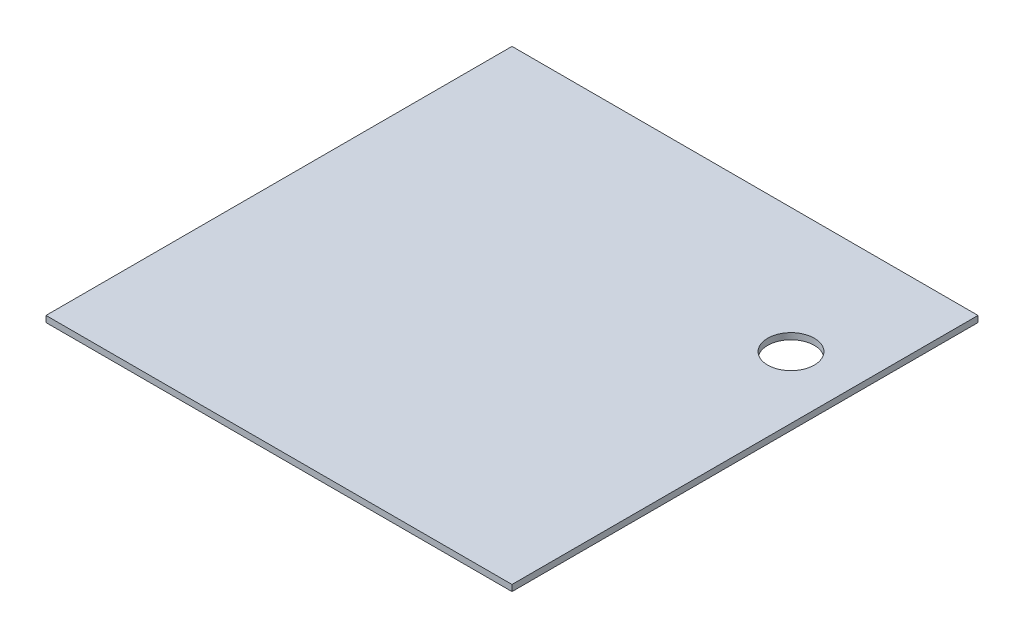
ISO-10303-21;
HEADER;
FILE_DESCRIPTION(('STEP AP214'),'2;1');
FILE_NAME('part.step','',(''),(''),'','','');
FILE_SCHEMA(('AUTOMOTIVE_DESIGN { 1 0 10303 214 1 1 1 1 }'));
ENDSEC;
DATA;
#1=APPLICATION_CONTEXT('core data for automotive mechanical design processes');
#2=APPLICATION_PROTOCOL_DEFINITION('international standard','automotive_design',2000,#1);
#3=PRODUCT_CONTEXT('',#1,'mechanical');
#4=PRODUCT('Part','Part','',(#3));
#5=PRODUCT_RELATED_PRODUCT_CATEGORY('part','',(#4));
#6=PRODUCT_DEFINITION_FORMATION('','',#4);
#7=PRODUCT_DEFINITION_CONTEXT('part definition',#1,'design');
#8=PRODUCT_DEFINITION('design','',#6,#7);
#9=PRODUCT_DEFINITION_SHAPE('','',#8);
#10=(LENGTH_UNIT() NAMED_UNIT(*) SI_UNIT(.MILLI.,.METRE.));
#11=(NAMED_UNIT(*) PLANE_ANGLE_UNIT() SI_UNIT($,.RADIAN.));
#12=(NAMED_UNIT(*) SI_UNIT($,.STERADIAN.) SOLID_ANGLE_UNIT());
#13=UNCERTAINTY_MEASURE_WITH_UNIT(LENGTH_MEASURE(1.E-05),#10,'distance_accuracy_value','');
#14=(GEOMETRIC_REPRESENTATION_CONTEXT(3) GLOBAL_UNCERTAINTY_ASSIGNED_CONTEXT((#13)) GLOBAL_UNIT_ASSIGNED_CONTEXT((#10,
#11,#12)) REPRESENTATION_CONTEXT('',''));
#15=CARTESIAN_POINT('',(0.,0.,0.));
#16=DIRECTION('',(0.,0.,1.));
#17=DIRECTION('',(1.,0.,0.));
#18=AXIS2_PLACEMENT_3D('',#15,#16,#17);
#19=CARTESIAN_POINT('',(75.,2.,-75.));
#20=DIRECTION('',(-1.,0.,0.));
#21=DIRECTION('',(0.,0.,1.));
#22=AXIS2_PLACEMENT_3D('',#19,#20,#21);
#23=PLANE('',#22);
#24=DIRECTION('',(0.,0.,-1.));
#25=VECTOR('',#24,1.);
#26=CARTESIAN_POINT('',(75.,0.,-75.));
#27=LINE('',#26,#25);
#28=CARTESIAN_POINT('',(75.,0.,75.));
#29=VERTEX_POINT('',#28);
#30=CARTESIAN_POINT('',(75.,0.,-75.));
#31=VERTEX_POINT('',#30);
#32=EDGE_CURVE('E97',#29,#31,#27,.T.);
#33=ORIENTED_EDGE('',*,*,#32,.T.);
#34=DIRECTION('',(0.,-1.,0.));
#35=VECTOR('',#34,1.);
#36=CARTESIAN_POINT('',(75.,2.,-75.));
#37=LINE('',#36,#35);
#38=CARTESIAN_POINT('',(75.,2.,-75.));
#39=VERTEX_POINT('',#38);
#40=EDGE_CURVE('E11',#39,#31,#37,.T.);
#41=ORIENTED_EDGE('',*,*,#40,.F.);
#42=DIRECTION('',(0.,0.,-1.));
#43=VECTOR('',#42,1.);
#44=CARTESIAN_POINT('',(75.,2.,-75.));
#45=LINE('',#44,#43);
#46=CARTESIAN_POINT('',(75.,2.,75.));
#47=VERTEX_POINT('',#46);
#48=EDGE_CURVE('E85',#47,#39,#45,.T.);
#49=ORIENTED_EDGE('',*,*,#48,.F.);
#50=DIRECTION('',(0.,-1.,0.));
#51=VECTOR('',#50,1.);
#52=CARTESIAN_POINT('',(75.,2.,75.));
#53=LINE('',#52,#51);
#54=EDGE_CURVE('E93',#47,#29,#53,.T.);
#55=ORIENTED_EDGE('',*,*,#54,.T.);
#56=EDGE_LOOP('',(#33,#41,#49,#55));
#57=FACE_BOUND('',#56,.T.);
#58=ADVANCED_FACE('F34',(#57),#23,.F.);
#59=CARTESIAN_POINT('',(-75.,2.,-75.));
#60=DIRECTION('',(0.,0.,1.));
#61=DIRECTION('',(1.,0.,0.));
#62=AXIS2_PLACEMENT_3D('',#59,#60,#61);
#63=PLANE('',#62);
#64=DIRECTION('',(-1.,0.,0.));
#65=VECTOR('',#64,1.);
#66=CARTESIAN_POINT('',(-75.,0.,-75.));
#67=LINE('',#66,#65);
#68=CARTESIAN_POINT('',(-75.,0.,-75.));
#69=VERTEX_POINT('',#68);
#70=EDGE_CURVE('E89',#31,#69,#67,.T.);
#71=ORIENTED_EDGE('',*,*,#70,.T.);
#72=DIRECTION('',(0.,-1.,0.));
#73=VECTOR('',#72,1.);
#74=CARTESIAN_POINT('',(-75.,2.,-75.));
#75=LINE('',#74,#73);
#76=CARTESIAN_POINT('',(-75.,2.,-75.));
#77=VERTEX_POINT('',#76);
#78=EDGE_CURVE('E42',#77,#69,#75,.T.);
#79=ORIENTED_EDGE('',*,*,#78,.F.);
#80=DIRECTION('',(-1.,0.,0.));
#81=VECTOR('',#80,1.);
#82=CARTESIAN_POINT('',(-75.,2.,-75.));
#83=LINE('',#82,#81);
#84=EDGE_CURVE('E80',#39,#77,#83,.T.);
#85=ORIENTED_EDGE('',*,*,#84,.F.);
#86=ORIENTED_EDGE('',*,*,#40,.T.);
#87=EDGE_LOOP('',(#71,#79,#85,#86));
#88=FACE_BOUND('',#87,.T.);
#89=ADVANCED_FACE('F88',(#88),#63,.F.);
#90=CARTESIAN_POINT('',(-75.,2.,-75.));
#91=DIRECTION('',(1.,0.,0.));
#92=DIRECTION('',(0.,0.,-1.));
#93=AXIS2_PLACEMENT_3D('',#90,#91,#92);
#94=PLANE('',#93);
#95=DIRECTION('',(0.,0.,1.));
#96=VECTOR('',#95,1.);
#97=CARTESIAN_POINT('',(-75.,0.,-75.));
#98=LINE('',#97,#96);
#99=CARTESIAN_POINT('',(-75.,0.,75.));
#100=VERTEX_POINT('',#99);
#101=EDGE_CURVE('E67',#69,#100,#98,.T.);
#102=ORIENTED_EDGE('',*,*,#101,.T.);
#103=DIRECTION('',(0.,-1.,0.));
#104=VECTOR('',#103,1.);
#105=CARTESIAN_POINT('',(-75.,2.,75.));
#106=LINE('',#105,#104);
#107=CARTESIAN_POINT('',(-75.,2.,75.));
#108=VERTEX_POINT('',#107);
#109=EDGE_CURVE('E90',#108,#100,#106,.T.);
#110=ORIENTED_EDGE('',*,*,#109,.F.);
#111=DIRECTION('',(0.,0.,1.));
#112=VECTOR('',#111,1.);
#113=CARTESIAN_POINT('',(-75.,2.,-75.));
#114=LINE('',#113,#112);
#115=EDGE_CURVE('E83',#77,#108,#114,.T.);
#116=ORIENTED_EDGE('',*,*,#115,.F.);
#117=ORIENTED_EDGE('',*,*,#78,.T.);
#118=EDGE_LOOP('',(#102,#110,#116,#117));
#119=FACE_BOUND('',#118,.T.);
#120=ADVANCED_FACE('F91',(#119),#94,.F.);
#121=CARTESIAN_POINT('',(-75.,2.,75.));
#122=DIRECTION('',(0.,0.,-1.));
#123=DIRECTION('',(-1.,0.,0.));
#124=AXIS2_PLACEMENT_3D('',#121,#122,#123);
#125=PLANE('',#124);
#126=DIRECTION('',(1.,0.,0.));
#127=VECTOR('',#126,1.);
#128=CARTESIAN_POINT('',(-75.,0.,75.));
#129=LINE('',#128,#127);
#130=EDGE_CURVE('E73',#100,#29,#129,.T.);
#131=ORIENTED_EDGE('',*,*,#130,.T.);
#132=ORIENTED_EDGE('',*,*,#54,.F.);
#133=DIRECTION('',(1.,0.,0.));
#134=VECTOR('',#133,1.);
#135=CARTESIAN_POINT('',(-75.,2.,75.));
#136=LINE('',#135,#134);
#137=EDGE_CURVE('E50',#108,#47,#136,.T.);
#138=ORIENTED_EDGE('',*,*,#137,.F.);
#139=ORIENTED_EDGE('',*,*,#109,.T.);
#140=EDGE_LOOP('',(#131,#132,#138,#139));
#141=FACE_BOUND('',#140,.T.);
#142=ADVANCED_FACE('F105',(#141),#125,.F.);
#143=CARTESIAN_POINT('',(0.,2.,0.));
#144=DIRECTION('',(0.,1.,0.));
#145=DIRECTION('',(0.,0.,1.));
#146=AXIS2_PLACEMENT_3D('',#143,#144,#145);
#147=PLANE('',#146);
#148=CARTESIAN_POINT('',(55.0000000000001,2.,-34.807));
#149=DIRECTION('',(0.,1.,0.));
#150=DIRECTION('',(0.,0.,1.));
#151=AXIS2_PLACEMENT_3D('',#148,#149,#150);
#152=CIRCLE('',#151,7.5);
#153=CARTESIAN_POINT('',(55.0000000000001,2.,-27.307));
#154=VERTEX_POINT('',#153);
#155=EDGE_CURVE('E113',#154,#154,#152,.T.);
#156=ORIENTED_EDGE('',*,*,#155,.F.);
#157=EDGE_LOOP('',(#156));
#158=FACE_BOUND('',#157,.T.);
#159=ORIENTED_EDGE('',*,*,#48,.T.);
#160=ORIENTED_EDGE('',*,*,#84,.T.);
#161=ORIENTED_EDGE('',*,*,#115,.T.);
#162=ORIENTED_EDGE('',*,*,#137,.T.);
#163=EDGE_LOOP('',(#159,#160,#161,#162));
#164=FACE_BOUND('',#163,.T.);
#165=ADVANCED_FACE('F81',(#158,#164),#147,.T.);
#166=CARTESIAN_POINT('',(0.,0.,0.));
#167=DIRECTION('',(0.,1.,0.));
#168=DIRECTION('',(0.,0.,1.));
#169=AXIS2_PLACEMENT_3D('',#166,#167,#168);
#170=PLANE('',#169);
#171=CARTESIAN_POINT('',(55.0000000000001,0.,-34.807));
#172=DIRECTION('',(0.,1.,0.));
#173=DIRECTION('',(0.,0.,1.));
#174=AXIS2_PLACEMENT_3D('',#171,#172,#173);
#175=CIRCLE('',#174,7.5);
#176=CARTESIAN_POINT('',(55.0000000000001,0.,-27.307));
#177=VERTEX_POINT('',#176);
#178=EDGE_CURVE('E100',#177,#177,#175,.F.);
#179=ORIENTED_EDGE('',*,*,#178,.F.);
#180=EDGE_LOOP('',(#179));
#181=FACE_BOUND('',#180,.T.);
#182=ORIENTED_EDGE('',*,*,#32,.F.);
#183=ORIENTED_EDGE('',*,*,#130,.F.);
#184=ORIENTED_EDGE('',*,*,#101,.F.);
#185=ORIENTED_EDGE('',*,*,#70,.F.);
#186=EDGE_LOOP('',(#182,#183,#184,#185));
#187=FACE_BOUND('',#186,.T.);
#188=ADVANCED_FACE('F108',(#181,#187),#170,.F.);
#189=CARTESIAN_POINT('',(55.0000000000001,-0.00100000000000013,-34.807));
#190=DIRECTION('',(0.,1.,0.));
#191=DIRECTION('',(0.,0.,1.));
#192=AXIS2_PLACEMENT_3D('',#189,#190,#191);
#193=CYLINDRICAL_SURFACE('',#192,7.5);
#194=ORIENTED_EDGE('',*,*,#155,.T.);
#195=EDGE_LOOP('',(#194));
#196=FACE_BOUND('',#195,.T.);
#197=ORIENTED_EDGE('',*,*,#178,.T.);
#198=EDGE_LOOP('',(#197));
#199=FACE_BOUND('',#198,.T.);
#200=ADVANCED_FACE('F117',(#196,#199),#193,.F.);
#201=CLOSED_SHELL('',(#58,#89,#120,#142,#165,#188,#200));
#202=MANIFOLD_SOLID_BREP('B2',#201);
#203=ADVANCED_BREP_SHAPE_REPRESENTATION('',(#18,#202),#14);
#204=SHAPE_DEFINITION_REPRESENTATION(#9,#203);
ENDSEC;
END-ISO-10303-21;
